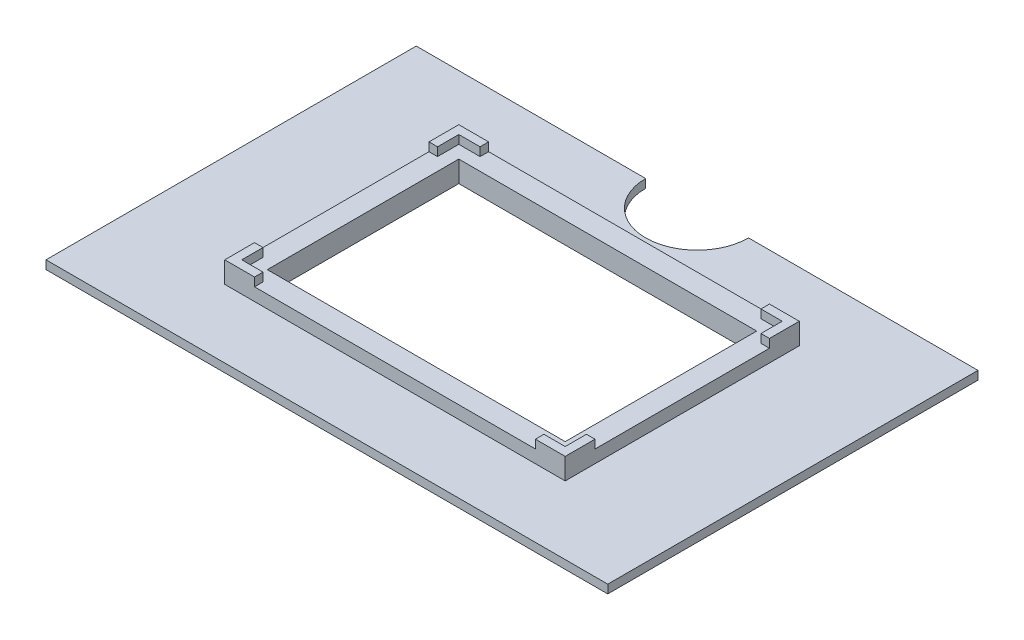
ISO-10303-21;
HEADER;
FILE_DESCRIPTION(('STEP AP214'),'2;1');
FILE_NAME('part.step','',(''),(''),'','','');
FILE_SCHEMA(('AUTOMOTIVE_DESIGN { 1 0 10303 214 1 1 1 1 }'));
ENDSEC;
DATA;
#1=APPLICATION_CONTEXT('core data for automotive mechanical design processes');
#2=APPLICATION_PROTOCOL_DEFINITION('international standard','automotive_design',2000,#1);
#3=PRODUCT_CONTEXT('',#1,'mechanical');
#4=PRODUCT('Part','Part','',(#3));
#5=PRODUCT_RELATED_PRODUCT_CATEGORY('part','',(#4));
#6=PRODUCT_DEFINITION_FORMATION('','',#4);
#7=PRODUCT_DEFINITION_CONTEXT('part definition',#1,'design');
#8=PRODUCT_DEFINITION('design','',#6,#7);
#9=PRODUCT_DEFINITION_SHAPE('','',#8);
#10=(LENGTH_UNIT() NAMED_UNIT(*) SI_UNIT(.MILLI.,.METRE.));
#11=(NAMED_UNIT(*) PLANE_ANGLE_UNIT() SI_UNIT($,.RADIAN.));
#12=(NAMED_UNIT(*) SI_UNIT($,.STERADIAN.) SOLID_ANGLE_UNIT());
#13=UNCERTAINTY_MEASURE_WITH_UNIT(LENGTH_MEASURE(1.E-05),#10,'distance_accuracy_value','');
#14=(GEOMETRIC_REPRESENTATION_CONTEXT(3) GLOBAL_UNCERTAINTY_ASSIGNED_CONTEXT((#13)) GLOBAL_UNIT_ASSIGNED_CONTEXT((#10,
#11,#12)) REPRESENTATION_CONTEXT('',''));
#15=CARTESIAN_POINT('',(0.,0.,0.));
#16=DIRECTION('',(0.,0.,1.));
#17=DIRECTION('',(1.,0.,0.));
#18=AXIS2_PLACEMENT_3D('',#15,#16,#17);
#19=CARTESIAN_POINT('',(66.,2.,-43.5));
#20=DIRECTION('',(0.,0.,1.));
#21=DIRECTION('',(1.,0.,0.));
#22=AXIS2_PLACEMENT_3D('',#19,#20,#21);
#23=PLANE('',#22);
#24=DIRECTION('',(-1.,0.,0.));
#25=VECTOR('',#24,1.);
#26=CARTESIAN_POINT('',(66.,0.,-43.5));
#27=LINE('',#26,#25);
#28=CARTESIAN_POINT('',(66.,0.,-43.5));
#29=VERTEX_POINT('',#28);
#30=CARTESIAN_POINT('',(12.0856084453727,0.,-43.5));
#31=VERTEX_POINT('',#30);
#32=EDGE_CURVE('E266',#29,#31,#27,.T.);
#33=ORIENTED_EDGE('',*,*,#32,.T.);
#34=DIRECTION('',(0.,1.,0.));
#35=VECTOR('',#34,1.);
#36=CARTESIAN_POINT('',(12.0856084453727,-27.0242420332989,-43.5));
#37=LINE('',#36,#35);
#38=CARTESIAN_POINT('',(12.0856084453727,2.,-43.5));
#39=VERTEX_POINT('',#38);
#40=EDGE_CURVE('E48',#31,#39,#37,.T.);
#41=ORIENTED_EDGE('',*,*,#40,.T.);
#42=DIRECTION('',(-1.,0.,0.));
#43=VECTOR('',#42,1.);
#44=CARTESIAN_POINT('',(66.,2.,-43.5));
#45=LINE('',#44,#43);
#46=CARTESIAN_POINT('',(66.,2.,-43.5));
#47=VERTEX_POINT('',#46);
#48=EDGE_CURVE('E264',#47,#39,#45,.T.);
#49=ORIENTED_EDGE('',*,*,#48,.F.);
#50=DIRECTION('',(0.,-1.,0.));
#51=VECTOR('',#50,1.);
#52=CARTESIAN_POINT('',(66.,2.,-43.5));
#53=LINE('',#52,#51);
#54=EDGE_CURVE('E277',#47,#29,#53,.T.);
#55=ORIENTED_EDGE('',*,*,#54,.T.);
#56=EDGE_LOOP('',(#33,#41,#49,#55));
#57=FACE_BOUND('',#56,.T.);
#58=ADVANCED_FACE('F33',(#57),#23,.F.);
#59=CARTESIAN_POINT('',(0.,7.,0.));
#60=DIRECTION('',(0.,1.,0.));
#61=DIRECTION('',(0.,0.,1.));
#62=AXIS2_PLACEMENT_3D('',#59,#60,#61);
#63=PLANE('',#62);
#64=DIRECTION('',(0.,0.,1.));
#65=VECTOR('',#64,1.);
#66=CARTESIAN_POINT('',(-33.,7.,27.5));
#67=LINE('',#66,#65);
#68=CARTESIAN_POINT('',(-33.,7.,25.5));
#69=VERTEX_POINT('',#68);
#70=CARTESIAN_POINT('',(-33.,7.,27.5));
#71=VERTEX_POINT('',#70);
#72=EDGE_CURVE('E306',#69,#71,#67,.T.);
#73=ORIENTED_EDGE('',*,*,#72,.F.);
#74=DIRECTION('',(1.,0.,0.));
#75=VECTOR('',#74,1.);
#76=CARTESIAN_POINT('',(38.,7.,25.5));
#77=LINE('',#76,#75);
#78=CARTESIAN_POINT('',(-38.,7.,25.5));
#79=VERTEX_POINT('',#78);
#80=EDGE_CURVE('E443',#79,#69,#77,.T.);
#81=ORIENTED_EDGE('',*,*,#80,.F.);
#82=DIRECTION('',(0.,0.,1.));
#83=VECTOR('',#82,1.);
#84=CARTESIAN_POINT('',(-38.,7.,25.5));
#85=LINE('',#84,#83);
#86=CARTESIAN_POINT('',(-38.,7.,20.5));
#87=VERTEX_POINT('',#86);
#88=EDGE_CURVE('E421',#87,#79,#85,.T.);
#89=ORIENTED_EDGE('',*,*,#88,.F.);
#90=DIRECTION('',(1.,0.,0.));
#91=VECTOR('',#90,1.);
#92=CARTESIAN_POINT('',(-38.,7.,20.5));
#93=LINE('',#92,#91);
#94=CARTESIAN_POINT('',(-40.,7.,20.5));
#95=VERTEX_POINT('',#94);
#96=EDGE_CURVE('E378',#95,#87,#93,.T.);
#97=ORIENTED_EDGE('',*,*,#96,.F.);
#98=DIRECTION('',(0.,0.,1.));
#99=VECTOR('',#98,1.);
#100=CARTESIAN_POINT('',(-40.,7.,27.5));
#101=LINE('',#100,#99);
#102=CARTESIAN_POINT('',(-40.,7.,27.5));
#103=VERTEX_POINT('',#102);
#104=EDGE_CURVE('E470',#95,#103,#101,.T.);
#105=ORIENTED_EDGE('',*,*,#104,.T.);
#106=DIRECTION('',(1.,0.,0.));
#107=VECTOR('',#106,1.);
#108=CARTESIAN_POINT('',(40.,7.,27.5));
#109=LINE('',#108,#107);
#110=EDGE_CURVE('E471',#103,#71,#109,.T.);
#111=ORIENTED_EDGE('',*,*,#110,.T.);
#112=EDGE_LOOP('',(#73,#81,#89,#97,#105,#111));
#113=FACE_BOUND('',#112,.T.);
#114=ADVANCED_FACE('F521',(#113),#63,.T.);
#115=CARTESIAN_POINT('',(38.,5.,25.5));
#116=DIRECTION('',(0.,0.,1.));
#117=DIRECTION('',(1.,0.,0.));
#118=AXIS2_PLACEMENT_3D('',#115,#116,#117);
#119=PLANE('',#118);
#120=ORIENTED_EDGE('',*,*,#80,.T.);
#121=DIRECTION('',(0.,1.,0.));
#122=VECTOR('',#121,1.);
#123=CARTESIAN_POINT('',(-33.,-61.0302960768767,25.5));
#124=LINE('',#123,#122);
#125=CARTESIAN_POINT('',(-33.,5.,25.5));
#126=VERTEX_POINT('',#125);
#127=EDGE_CURVE('E320',#126,#69,#124,.T.);
#128=ORIENTED_EDGE('',*,*,#127,.F.);
#129=DIRECTION('',(1.,0.,0.));
#130=VECTOR('',#129,1.);
#131=CARTESIAN_POINT('',(38.,5.,25.5));
#132=LINE('',#131,#130);
#133=CARTESIAN_POINT('',(-38.,5.,25.5));
#134=VERTEX_POINT('',#133);
#135=EDGE_CURVE('E427',#134,#126,#132,.T.);
#136=ORIENTED_EDGE('',*,*,#135,.F.);
#137=DIRECTION('',(0.,1.,0.));
#138=VECTOR('',#137,1.);
#139=CARTESIAN_POINT('',(-38.,5.,25.5));
#140=LINE('',#139,#138);
#141=EDGE_CURVE('E438',#134,#79,#140,.T.);
#142=ORIENTED_EDGE('',*,*,#141,.T.);
#143=EDGE_LOOP('',(#120,#128,#136,#142));
#144=FACE_BOUND('',#143,.T.);
#145=ADVANCED_FACE('F526',(#144),#119,.F.);
#146=DIRECTION('',(0.,0.,1.));
#147=VECTOR('',#146,1.);
#148=CARTESIAN_POINT('',(-33.,7.,-27.5));
#149=LINE('',#148,#147);
#150=CARTESIAN_POINT('',(-33.,7.,-27.5));
#151=VERTEX_POINT('',#150);
#152=CARTESIAN_POINT('',(-33.,7.,-25.5));
#153=VERTEX_POINT('',#152);
#154=EDGE_CURVE('E327',#151,#153,#149,.T.);
#155=ORIENTED_EDGE('',*,*,#154,.F.);
#156=DIRECTION('',(-1.,0.,0.));
#157=VECTOR('',#156,1.);
#158=CARTESIAN_POINT('',(40.,7.,-27.5));
#159=LINE('',#158,#157);
#160=CARTESIAN_POINT('',(-40.,7.,-27.5));
#161=VERTEX_POINT('',#160);
#162=EDGE_CURVE('E478',#151,#161,#159,.T.);
#163=ORIENTED_EDGE('',*,*,#162,.T.);
#164=CARTESIAN_POINT('',(-40.,7.,-20.5));
#165=VERTEX_POINT('',#164);
#166=EDGE_CURVE('E466',#161,#165,#101,.T.);
#167=ORIENTED_EDGE('',*,*,#166,.T.);
#168=DIRECTION('',(-1.,0.,0.));
#169=VECTOR('',#168,1.);
#170=CARTESIAN_POINT('',(-38.,7.,-20.5));
#171=LINE('',#170,#169);
#172=CARTESIAN_POINT('',(-38.,7.,-20.5));
#173=VERTEX_POINT('',#172);
#174=EDGE_CURVE('E369',#173,#165,#171,.T.);
#175=ORIENTED_EDGE('',*,*,#174,.F.);
#176=CARTESIAN_POINT('',(-38.,7.,-25.5));
#177=VERTEX_POINT('',#176);
#178=EDGE_CURVE('E439',#177,#173,#85,.T.);
#179=ORIENTED_EDGE('',*,*,#178,.F.);
#180=DIRECTION('',(-1.,0.,0.));
#181=VECTOR('',#180,1.);
#182=CARTESIAN_POINT('',(38.,7.,-25.5));
#183=LINE('',#182,#181);
#184=EDGE_CURVE('E450',#153,#177,#183,.T.);
#185=ORIENTED_EDGE('',*,*,#184,.F.);
#186=EDGE_LOOP('',(#155,#163,#167,#175,#179,#185));
#187=FACE_BOUND('',#186,.T.);
#188=ADVANCED_FACE('F529',(#187),#63,.T.);
#189=CARTESIAN_POINT('',(38.,5.,-25.5));
#190=DIRECTION('',(0.,0.,-1.));
#191=DIRECTION('',(-1.,0.,0.));
#192=AXIS2_PLACEMENT_3D('',#189,#190,#191);
#193=PLANE('',#192);
#194=DIRECTION('',(-1.,0.,0.));
#195=VECTOR('',#194,1.);
#196=CARTESIAN_POINT('',(38.,5.,-25.5));
#197=LINE('',#196,#195);
#198=CARTESIAN_POINT('',(-33.,5.,-25.5));
#199=VERTEX_POINT('',#198);
#200=CARTESIAN_POINT('',(-38.,5.,-25.5));
#201=VERTEX_POINT('',#200);
#202=EDGE_CURVE('E434',#199,#201,#197,.T.);
#203=ORIENTED_EDGE('',*,*,#202,.F.);
#204=DIRECTION('',(0.,1.,0.));
#205=VECTOR('',#204,1.);
#206=CARTESIAN_POINT('',(-33.,-61.0302960768767,-25.5));
#207=LINE('',#206,#205);
#208=EDGE_CURVE('E340',#199,#153,#207,.T.);
#209=ORIENTED_EDGE('',*,*,#208,.T.);
#210=ORIENTED_EDGE('',*,*,#184,.T.);
#211=DIRECTION('',(0.,1.,0.));
#212=VECTOR('',#211,1.);
#213=CARTESIAN_POINT('',(-38.,5.,-25.5));
#214=LINE('',#213,#212);
#215=EDGE_CURVE('E454',#201,#177,#214,.T.);
#216=ORIENTED_EDGE('',*,*,#215,.F.);
#217=EDGE_LOOP('',(#203,#209,#210,#216));
#218=FACE_BOUND('',#217,.T.);
#219=ADVANCED_FACE('F541',(#218),#193,.F.);
#220=DIRECTION('',(0.,0.,-1.));
#221=VECTOR('',#220,1.);
#222=CARTESIAN_POINT('',(33.,7.,-27.5));
#223=LINE('',#222,#221);
#224=CARTESIAN_POINT('',(33.,7.,-25.5));
#225=VERTEX_POINT('',#224);
#226=CARTESIAN_POINT('',(33.,7.,-27.5));
#227=VERTEX_POINT('',#226);
#228=EDGE_CURVE('E338',#225,#227,#223,.T.);
#229=ORIENTED_EDGE('',*,*,#228,.F.);
#230=CARTESIAN_POINT('',(38.,7.,-25.5));
#231=VERTEX_POINT('',#230);
#232=EDGE_CURVE('E451',#231,#225,#183,.T.);
#233=ORIENTED_EDGE('',*,*,#232,.F.);
#234=DIRECTION('',(0.,0.,-1.));
#235=VECTOR('',#234,1.);
#236=CARTESIAN_POINT('',(38.,7.,25.5));
#237=LINE('',#236,#235);
#238=CARTESIAN_POINT('',(38.,7.,-20.5));
#239=VERTEX_POINT('',#238);
#240=EDGE_CURVE('E446',#239,#231,#237,.T.);
#241=ORIENTED_EDGE('',*,*,#240,.F.);
#242=DIRECTION('',(-1.,0.,0.));
#243=VECTOR('',#242,1.);
#244=CARTESIAN_POINT('',(38.,7.,-20.5));
#245=LINE('',#244,#243);
#246=CARTESIAN_POINT('',(40.,7.,-20.5));
#247=VERTEX_POINT('',#246);
#248=EDGE_CURVE('E357',#247,#239,#245,.T.);
#249=ORIENTED_EDGE('',*,*,#248,.F.);
#250=DIRECTION('',(0.,0.,-1.));
#251=VECTOR('',#250,1.);
#252=CARTESIAN_POINT('',(40.,7.,27.5));
#253=LINE('',#252,#251);
#254=CARTESIAN_POINT('',(40.,7.,-27.5));
#255=VERTEX_POINT('',#254);
#256=EDGE_CURVE('E474',#247,#255,#253,.T.);
#257=ORIENTED_EDGE('',*,*,#256,.T.);
#258=EDGE_CURVE('E479',#255,#227,#159,.T.);
#259=ORIENTED_EDGE('',*,*,#258,.T.);
#260=EDGE_LOOP('',(#229,#233,#241,#249,#257,#259));
#261=FACE_BOUND('',#260,.T.);
#262=ADVANCED_FACE('F543',(#261),#63,.T.);
#263=CARTESIAN_POINT('',(38.,5.,25.5));
#264=DIRECTION('',(1.,0.,0.));
#265=DIRECTION('',(0.,0.,-1.));
#266=AXIS2_PLACEMENT_3D('',#263,#264,#265);
#267=PLANE('',#266);
#268=DIRECTION('',(0.,0.,-1.));
#269=VECTOR('',#268,1.);
#270=CARTESIAN_POINT('',(38.,5.,25.5));
#271=LINE('',#270,#269);
#272=CARTESIAN_POINT('',(38.,5.,-20.5));
#273=VERTEX_POINT('',#272);
#274=CARTESIAN_POINT('',(38.,5.,-25.5));
#275=VERTEX_POINT('',#274);
#276=EDGE_CURVE('E430',#273,#275,#271,.T.);
#277=ORIENTED_EDGE('',*,*,#276,.F.);
#278=DIRECTION('',(0.,1.,0.));
#279=VECTOR('',#278,1.);
#280=CARTESIAN_POINT('',(38.,-61.0302960768767,-20.5));
#281=LINE('',#280,#279);
#282=EDGE_CURVE('E353',#273,#239,#281,.T.);
#283=ORIENTED_EDGE('',*,*,#282,.T.);
#284=ORIENTED_EDGE('',*,*,#240,.T.);
#285=DIRECTION('',(0.,1.,0.));
#286=VECTOR('',#285,1.);
#287=CARTESIAN_POINT('',(38.,5.,-25.5));
#288=LINE('',#287,#286);
#289=EDGE_CURVE('E458',#275,#231,#288,.T.);
#290=ORIENTED_EDGE('',*,*,#289,.F.);
#291=EDGE_LOOP('',(#277,#283,#284,#290));
#292=FACE_BOUND('',#291,.T.);
#293=ADVANCED_FACE('F559',(#292),#267,.F.);
#294=CARTESIAN_POINT('',(-38.,5.,25.5));
#295=DIRECTION('',(-1.,0.,0.));
#296=DIRECTION('',(0.,0.,1.));
#297=AXIS2_PLACEMENT_3D('',#294,#295,#296);
#298=PLANE('',#297);
#299=DIRECTION('',(0.,0.,1.));
#300=VECTOR('',#299,1.);
#301=CARTESIAN_POINT('',(-38.,5.,25.5));
#302=LINE('',#301,#300);
#303=CARTESIAN_POINT('',(-38.,5.,20.5));
#304=VERTEX_POINT('',#303);
#305=EDGE_CURVE('E426',#304,#134,#302,.T.);
#306=ORIENTED_EDGE('',*,*,#305,.F.);
#307=DIRECTION('',(0.,1.,0.));
#308=VECTOR('',#307,1.);
#309=CARTESIAN_POINT('',(-38.,-61.0302960768767,20.5));
#310=LINE('',#309,#308);
#311=EDGE_CURVE('E374',#304,#87,#310,.T.);
#312=ORIENTED_EDGE('',*,*,#311,.T.);
#313=ORIENTED_EDGE('',*,*,#88,.T.);
#314=ORIENTED_EDGE('',*,*,#141,.F.);
#315=EDGE_LOOP('',(#306,#312,#313,#314));
#316=FACE_BOUND('',#315,.T.);
#317=ADVANCED_FACE('F554',(#316),#298,.F.);
#318=CARTESIAN_POINT('',(0.,2.,0.));
#319=DIRECTION('',(0.,1.,0.));
#320=DIRECTION('',(0.,0.,1.));
#321=AXIS2_PLACEMENT_3D('',#318,#319,#320);
#322=PLANE('',#321);
#323=CARTESIAN_POINT('',(0.,2.,-43.5));
#324=DIRECTION('',(0.,1.,0.));
#325=DIRECTION('',(0.,0.,1.));
#326=AXIS2_PLACEMENT_3D('',#323,#324,#325);
#327=CIRCLE('',#326,12.0856084453727);
#328=CARTESIAN_POINT('',(-12.0856084453727,2.,-43.5));
#329=VERTEX_POINT('',#328);
#330=EDGE_CURVE('E252',#329,#39,#327,.T.);
#331=ORIENTED_EDGE('',*,*,#330,.F.);
#332=CARTESIAN_POINT('',(-66.,2.,-43.5));
#333=VERTEX_POINT('',#332);
#334=EDGE_CURVE('E274',#329,#333,#45,.T.);
#335=ORIENTED_EDGE('',*,*,#334,.T.);
#336=DIRECTION('',(0.,0.,1.));
#337=VECTOR('',#336,1.);
#338=CARTESIAN_POINT('',(-66.,2.,43.5));
#339=LINE('',#338,#337);
#340=CARTESIAN_POINT('',(-66.,2.,43.5));
#341=VERTEX_POINT('',#340);
#342=EDGE_CURVE('E291',#333,#341,#339,.T.);
#343=ORIENTED_EDGE('',*,*,#342,.T.);
#344=DIRECTION('',(1.,0.,0.));
#345=VECTOR('',#344,1.);
#346=CARTESIAN_POINT('',(66.,2.,43.5));
#347=LINE('',#346,#345);
#348=CARTESIAN_POINT('',(66.,2.,43.5));
#349=VERTEX_POINT('',#348);
#350=EDGE_CURVE('E501',#341,#349,#347,.T.);
#351=ORIENTED_EDGE('',*,*,#350,.T.);
#352=DIRECTION('',(0.,0.,-1.));
#353=VECTOR('',#352,1.);
#354=CARTESIAN_POINT('',(66.,2.,43.5));
#355=LINE('',#354,#353);
#356=EDGE_CURVE('E271',#349,#47,#355,.T.);
#357=ORIENTED_EDGE('',*,*,#356,.T.);
#358=ORIENTED_EDGE('',*,*,#48,.T.);
#359=EDGE_LOOP('',(#331,#335,#343,#351,#357,#358));
#360=FACE_BOUND('',#359,.T.);
#361=DIRECTION('',(1.,0.,0.));
#362=VECTOR('',#361,1.);
#363=CARTESIAN_POINT('',(40.,2.,27.5));
#364=LINE('',#363,#362);
#365=CARTESIAN_POINT('',(-40.,2.,27.5));
#366=VERTEX_POINT('',#365);
#367=CARTESIAN_POINT('',(40.,2.,27.5));
#368=VERTEX_POINT('',#367);
#369=EDGE_CURVE('E485',#366,#368,#364,.T.);
#370=ORIENTED_EDGE('',*,*,#369,.F.);
#371=DIRECTION('',(0.,0.,1.));
#372=VECTOR('',#371,1.);
#373=CARTESIAN_POINT('',(-40.,2.,27.5));
#374=LINE('',#373,#372);
#375=CARTESIAN_POINT('',(-40.,2.,-27.5));
#376=VERTEX_POINT('',#375);
#377=EDGE_CURVE('E457',#376,#366,#374,.T.);
#378=ORIENTED_EDGE('',*,*,#377,.F.);
#379=DIRECTION('',(-1.,0.,0.));
#380=VECTOR('',#379,1.);
#381=CARTESIAN_POINT('',(40.,2.,-27.5));
#382=LINE('',#381,#380);
#383=CARTESIAN_POINT('',(40.,2.,-27.5));
#384=VERTEX_POINT('',#383);
#385=EDGE_CURVE('E490',#384,#376,#382,.T.);
#386=ORIENTED_EDGE('',*,*,#385,.F.);
#387=DIRECTION('',(0.,0.,-1.));
#388=VECTOR('',#387,1.);
#389=CARTESIAN_POINT('',(40.,2.,27.5));
#390=LINE('',#389,#388);
#391=EDGE_CURVE('E487',#368,#384,#390,.T.);
#392=ORIENTED_EDGE('',*,*,#391,.F.);
#393=EDGE_LOOP('',(#370,#378,#386,#392));
#394=FACE_BOUND('',#393,.T.);
#395=ADVANCED_FACE('F268',(#360,#394),#322,.T.);
#396=CARTESIAN_POINT('',(-66.,2.,43.5));
#397=DIRECTION('',(1.,0.,0.));
#398=DIRECTION('',(0.,0.,-1.));
#399=AXIS2_PLACEMENT_3D('',#396,#397,#398);
#400=PLANE('',#399);
#401=DIRECTION('',(0.,0.,1.));
#402=VECTOR('',#401,1.);
#403=CARTESIAN_POINT('',(-66.,0.,43.5));
#404=LINE('',#403,#402);
#405=CARTESIAN_POINT('',(-66.,0.,-43.5));
#406=VERTEX_POINT('',#405);
#407=CARTESIAN_POINT('',(-66.,0.,43.5));
#408=VERTEX_POINT('',#407);
#409=EDGE_CURVE('E282',#406,#408,#404,.T.);
#410=ORIENTED_EDGE('',*,*,#409,.T.);
#411=DIRECTION('',(0.,-1.,0.));
#412=VECTOR('',#411,1.);
#413=CARTESIAN_POINT('',(-66.,2.,43.5));
#414=LINE('',#413,#412);
#415=EDGE_CURVE('E11',#341,#408,#414,.T.);
#416=ORIENTED_EDGE('',*,*,#415,.F.);
#417=ORIENTED_EDGE('',*,*,#342,.F.);
#418=DIRECTION('',(0.,-1.,0.));
#419=VECTOR('',#418,1.);
#420=CARTESIAN_POINT('',(-66.,2.,-43.5));
#421=LINE('',#420,#419);
#422=EDGE_CURVE('E273',#333,#406,#421,.T.);
#423=ORIENTED_EDGE('',*,*,#422,.T.);
#424=EDGE_LOOP('',(#410,#416,#417,#423));
#425=FACE_BOUND('',#424,.T.);
#426=ADVANCED_FACE('F35',(#425),#400,.F.);
#427=CARTESIAN_POINT('',(66.,2.,43.5));
#428=DIRECTION('',(0.,0.,-1.));
#429=DIRECTION('',(-1.,0.,0.));
#430=AXIS2_PLACEMENT_3D('',#427,#428,#429);
#431=PLANE('',#430);
#432=DIRECTION('',(1.,0.,0.));
#433=VECTOR('',#432,1.);
#434=CARTESIAN_POINT('',(66.,0.,43.5));
#435=LINE('',#434,#433);
#436=CARTESIAN_POINT('',(66.,0.,43.5));
#437=VERTEX_POINT('',#436);
#438=EDGE_CURVE('E285',#408,#437,#435,.T.);
#439=ORIENTED_EDGE('',*,*,#438,.T.);
#440=DIRECTION('',(0.,-1.,0.));
#441=VECTOR('',#440,1.);
#442=CARTESIAN_POINT('',(66.,2.,43.5));
#443=LINE('',#442,#441);
#444=EDGE_CURVE('E41',#349,#437,#443,.T.);
#445=ORIENTED_EDGE('',*,*,#444,.F.);
#446=ORIENTED_EDGE('',*,*,#350,.F.);
#447=ORIENTED_EDGE('',*,*,#415,.T.);
#448=EDGE_LOOP('',(#439,#445,#446,#447));
#449=FACE_BOUND('',#448,.T.);
#450=ADVANCED_FACE('F504',(#449),#431,.F.);
#451=CARTESIAN_POINT('',(66.,2.,43.5));
#452=DIRECTION('',(-1.,0.,0.));
#453=DIRECTION('',(0.,0.,1.));
#454=AXIS2_PLACEMENT_3D('',#451,#452,#453);
#455=PLANE('',#454);
#456=DIRECTION('',(0.,0.,-1.));
#457=VECTOR('',#456,1.);
#458=CARTESIAN_POINT('',(66.,0.,43.5));
#459=LINE('',#458,#457);
#460=EDGE_CURVE('E288',#437,#29,#459,.T.);
#461=ORIENTED_EDGE('',*,*,#460,.T.);
#462=ORIENTED_EDGE('',*,*,#54,.F.);
#463=ORIENTED_EDGE('',*,*,#356,.F.);
#464=ORIENTED_EDGE('',*,*,#444,.T.);
#465=EDGE_LOOP('',(#461,#462,#463,#464));
#466=FACE_BOUND('',#465,.T.);
#467=ADVANCED_FACE('F297',(#466),#455,.F.);
#468=ORIENTED_EDGE('',*,*,#334,.F.);
#469=DIRECTION('',(0.,1.,0.));
#470=VECTOR('',#469,1.);
#471=CARTESIAN_POINT('',(-12.0856084453727,-27.0242420332989,-43.5));
#472=LINE('',#471,#470);
#473=CARTESIAN_POINT('',(-12.0856084453727,0.,-43.5));
#474=VERTEX_POINT('',#473);
#475=EDGE_CURVE('E255',#474,#329,#472,.T.);
#476=ORIENTED_EDGE('',*,*,#475,.F.);
#477=EDGE_CURVE('E290',#474,#406,#27,.T.);
#478=ORIENTED_EDGE('',*,*,#477,.T.);
#479=ORIENTED_EDGE('',*,*,#422,.F.);
#480=EDGE_LOOP('',(#468,#476,#478,#479));
#481=FACE_BOUND('',#480,.T.);
#482=ADVANCED_FACE('F508',(#481),#23,.F.);
#483=CARTESIAN_POINT('',(0.,0.,0.));
#484=DIRECTION('',(0.,1.,0.));
#485=DIRECTION('',(0.,0.,1.));
#486=AXIS2_PLACEMENT_3D('',#483,#484,#485);
#487=PLANE('',#486);
#488=DIRECTION('',(-1.,0.,0.));
#489=VECTOR('',#488,1.);
#490=CARTESIAN_POINT('',(-35.,0.,22.5));
#491=LINE('',#490,#489);
#492=CARTESIAN_POINT('',(35.,0.,22.5));
#493=VERTEX_POINT('',#492);
#494=CARTESIAN_POINT('',(-35.,0.,22.5));
#495=VERTEX_POINT('',#494);
#496=EDGE_CURVE('E392',#493,#495,#491,.T.);
#497=ORIENTED_EDGE('',*,*,#496,.F.);
#498=DIRECTION('',(0.,0.,1.));
#499=VECTOR('',#498,1.);
#500=CARTESIAN_POINT('',(35.,0.,-22.5));
#501=LINE('',#500,#499);
#502=CARTESIAN_POINT('',(35.,0.,-22.5));
#503=VERTEX_POINT('',#502);
#504=EDGE_CURVE('E395',#503,#493,#501,.T.);
#505=ORIENTED_EDGE('',*,*,#504,.F.);
#506=DIRECTION('',(1.,0.,0.));
#507=VECTOR('',#506,1.);
#508=CARTESIAN_POINT('',(-35.,0.,-22.5));
#509=LINE('',#508,#507);
#510=CARTESIAN_POINT('',(-35.,0.,-22.5));
#511=VERTEX_POINT('',#510);
#512=EDGE_CURVE('E412',#511,#503,#509,.T.);
#513=ORIENTED_EDGE('',*,*,#512,.F.);
#514=DIRECTION('',(0.,0.,-1.));
#515=VECTOR('',#514,1.);
#516=CARTESIAN_POINT('',(-35.,0.,-22.5));
#517=LINE('',#516,#515);
#518=EDGE_CURVE('E390',#495,#511,#517,.T.);
#519=ORIENTED_EDGE('',*,*,#518,.F.);
#520=EDGE_LOOP('',(#497,#505,#513,#519));
#521=FACE_BOUND('',#520,.T.);
#522=ORIENTED_EDGE('',*,*,#477,.F.);
#523=CARTESIAN_POINT('',(0.,0.,-43.5));
#524=DIRECTION('',(0.,1.,0.));
#525=DIRECTION('',(0.,0.,1.));
#526=AXIS2_PLACEMENT_3D('',#523,#524,#525);
#527=CIRCLE('',#526,12.0856084453727);
#528=EDGE_CURVE('E303',#31,#474,#527,.F.);
#529=ORIENTED_EDGE('',*,*,#528,.F.);
#530=ORIENTED_EDGE('',*,*,#32,.F.);
#531=ORIENTED_EDGE('',*,*,#460,.F.);
#532=ORIENTED_EDGE('',*,*,#438,.F.);
#533=ORIENTED_EDGE('',*,*,#409,.F.);
#534=EDGE_LOOP('',(#522,#529,#530,#531,#532,#533));
#535=FACE_BOUND('',#534,.T.);
#536=ADVANCED_FACE('F301',(#521,#535),#487,.F.);
#537=CARTESIAN_POINT('',(-40.,7.,27.5));
#538=DIRECTION('',(1.,0.,0.));
#539=DIRECTION('',(0.,0.,-1.));
#540=AXIS2_PLACEMENT_3D('',#537,#538,#539);
#541=PLANE('',#540);
#542=ORIENTED_EDGE('',*,*,#104,.F.);
#543=DIRECTION('',(0.,1.,0.));
#544=VECTOR('',#543,1.);
#545=CARTESIAN_POINT('',(-40.,-61.0302960768767,20.5));
#546=LINE('',#545,#544);
#547=CARTESIAN_POINT('',(-40.,5.,20.5));
#548=VERTEX_POINT('',#547);
#549=EDGE_CURVE('E383',#548,#95,#546,.T.);
#550=ORIENTED_EDGE('',*,*,#549,.F.);
#551=DIRECTION('',(0.,0.,-1.));
#552=VECTOR('',#551,1.);
#553=CARTESIAN_POINT('',(-40.,5.,-20.5));
#554=LINE('',#553,#552);
#555=CARTESIAN_POINT('',(-40.,5.,-20.5));
#556=VERTEX_POINT('',#555);
#557=EDGE_CURVE('E370',#548,#556,#554,.T.);
#558=ORIENTED_EDGE('',*,*,#557,.T.);
#559=DIRECTION('',(0.,1.,0.));
#560=VECTOR('',#559,1.);
#561=CARTESIAN_POINT('',(-40.,-61.0302960768767,-20.5));
#562=LINE('',#561,#560);
#563=EDGE_CURVE('E385',#556,#165,#562,.T.);
#564=ORIENTED_EDGE('',*,*,#563,.T.);
#565=ORIENTED_EDGE('',*,*,#166,.F.);
#566=DIRECTION('',(0.,-1.,0.));
#567=VECTOR('',#566,1.);
#568=CARTESIAN_POINT('',(-40.,7.,-27.5));
#569=LINE('',#568,#567);
#570=EDGE_CURVE('E482',#161,#376,#569,.T.);
#571=ORIENTED_EDGE('',*,*,#570,.T.);
#572=ORIENTED_EDGE('',*,*,#377,.T.);
#573=DIRECTION('',(0.,-1.,0.));
#574=VECTOR('',#573,1.);
#575=CARTESIAN_POINT('',(-40.,7.,27.5));
#576=LINE('',#575,#574);
#577=EDGE_CURVE('E286',#103,#366,#576,.T.);
#578=ORIENTED_EDGE('',*,*,#577,.F.);
#579=EDGE_LOOP('',(#542,#550,#558,#564,#565,#571,#572,#578));
#580=FACE_BOUND('',#579,.T.);
#581=ADVANCED_FACE('F515',(#580),#541,.F.);
#582=CARTESIAN_POINT('',(40.,7.,27.5));
#583=DIRECTION('',(0.,0.,-1.));
#584=DIRECTION('',(-1.,0.,0.));
#585=AXIS2_PLACEMENT_3D('',#582,#583,#584);
#586=PLANE('',#585);
#587=DIRECTION('',(-1.,0.,0.));
#588=VECTOR('',#587,1.);
#589=CARTESIAN_POINT('',(-33.,5.,27.5));
#590=LINE('',#589,#588);
#591=CARTESIAN_POINT('',(33.,5.,27.5));
#592=VERTEX_POINT('',#591);
#593=CARTESIAN_POINT('',(-33.,5.,27.5));
#594=VERTEX_POINT('',#593);
#595=EDGE_CURVE('E312',#592,#594,#590,.T.);
#596=ORIENTED_EDGE('',*,*,#595,.T.);
#597=DIRECTION('',(0.,1.,0.));
#598=VECTOR('',#597,1.);
#599=CARTESIAN_POINT('',(-33.,-61.0302960768767,27.5));
#600=LINE('',#599,#598);
#601=EDGE_CURVE('E313',#594,#71,#600,.T.);
#602=ORIENTED_EDGE('',*,*,#601,.T.);
#603=ORIENTED_EDGE('',*,*,#110,.F.);
#604=ORIENTED_EDGE('',*,*,#577,.T.);
#605=ORIENTED_EDGE('',*,*,#369,.T.);
#606=DIRECTION('',(0.,-1.,0.));
#607=VECTOR('',#606,1.);
#608=CARTESIAN_POINT('',(40.,7.,27.5));
#609=LINE('',#608,#607);
#610=CARTESIAN_POINT('',(40.,7.,27.5));
#611=VERTEX_POINT('',#610);
#612=EDGE_CURVE('E496',#611,#368,#609,.T.);
#613=ORIENTED_EDGE('',*,*,#612,.F.);
#614=CARTESIAN_POINT('',(33.,7.,27.5));
#615=VERTEX_POINT('',#614);
#616=EDGE_CURVE('E469',#615,#611,#109,.T.);
#617=ORIENTED_EDGE('',*,*,#616,.F.);
#618=DIRECTION('',(0.,1.,0.));
#619=VECTOR('',#618,1.);
#620=CARTESIAN_POINT('',(33.,-61.0302960768767,27.5));
#621=LINE('',#620,#619);
#622=EDGE_CURVE('E317',#592,#615,#621,.T.);
#623=ORIENTED_EDGE('',*,*,#622,.F.);
#624=EDGE_LOOP('',(#596,#602,#603,#604,#605,#613,#617,#623));
#625=FACE_BOUND('',#624,.T.);
#626=ADVANCED_FACE('F688',(#625),#586,.F.);
#627=CARTESIAN_POINT('',(40.,7.,27.5));
#628=DIRECTION('',(-1.,0.,0.));
#629=DIRECTION('',(0.,0.,1.));
#630=AXIS2_PLACEMENT_3D('',#627,#628,#629);
#631=PLANE('',#630);
#632=ORIENTED_EDGE('',*,*,#256,.F.);
#633=DIRECTION('',(0.,1.,0.));
#634=VECTOR('',#633,1.);
#635=CARTESIAN_POINT('',(40.,-61.0302960768767,-20.5));
#636=LINE('',#635,#634);
#637=CARTESIAN_POINT('',(40.,5.,-20.5));
#638=VERTEX_POINT('',#637);
#639=EDGE_CURVE('E362',#638,#247,#636,.T.);
#640=ORIENTED_EDGE('',*,*,#639,.F.);
#641=DIRECTION('',(0.,0.,1.));
#642=VECTOR('',#641,1.);
#643=CARTESIAN_POINT('',(40.,5.,-20.5));
#644=LINE('',#643,#642);
#645=CARTESIAN_POINT('',(40.,5.,20.5));
#646=VERTEX_POINT('',#645);
#647=EDGE_CURVE('E349',#638,#646,#644,.T.);
#648=ORIENTED_EDGE('',*,*,#647,.T.);
#649=DIRECTION('',(0.,1.,0.));
#650=VECTOR('',#649,1.);
#651=CARTESIAN_POINT('',(40.,-61.0302960768767,20.5));
#652=LINE('',#651,#650);
#653=CARTESIAN_POINT('',(40.,7.,20.5));
#654=VERTEX_POINT('',#653);
#655=EDGE_CURVE('E364',#646,#654,#652,.T.);
#656=ORIENTED_EDGE('',*,*,#655,.T.);
#657=EDGE_CURVE('E475',#611,#654,#253,.T.);
#658=ORIENTED_EDGE('',*,*,#657,.F.);
#659=ORIENTED_EDGE('',*,*,#612,.T.);
#660=ORIENTED_EDGE('',*,*,#391,.T.);
#661=DIRECTION('',(0.,-1.,0.));
#662=VECTOR('',#661,1.);
#663=CARTESIAN_POINT('',(40.,7.,-27.5));
#664=LINE('',#663,#662);
#665=EDGE_CURVE('E494',#255,#384,#664,.T.);
#666=ORIENTED_EDGE('',*,*,#665,.F.);
#667=EDGE_LOOP('',(#632,#640,#648,#656,#658,#659,#660,#666));
#668=FACE_BOUND('',#667,.T.);
#669=ADVANCED_FACE('F555',(#668),#631,.F.);
#670=CARTESIAN_POINT('',(40.,7.,-27.5));
#671=DIRECTION('',(0.,0.,1.));
#672=DIRECTION('',(1.,0.,0.));
#673=AXIS2_PLACEMENT_3D('',#670,#671,#672);
#674=PLANE('',#673);
#675=ORIENTED_EDGE('',*,*,#162,.F.);
#676=DIRECTION('',(0.,1.,0.));
#677=VECTOR('',#676,1.);
#678=CARTESIAN_POINT('',(-33.,-61.0302960768767,-27.5));
#679=LINE('',#678,#677);
#680=CARTESIAN_POINT('',(-33.,5.,-27.5));
#681=VERTEX_POINT('',#680);
#682=EDGE_CURVE('E331',#681,#151,#679,.T.);
#683=ORIENTED_EDGE('',*,*,#682,.F.);
#684=DIRECTION('',(1.,0.,0.));
#685=VECTOR('',#684,1.);
#686=CARTESIAN_POINT('',(-33.,5.,-27.5));
#687=LINE('',#686,#685);
#688=CARTESIAN_POINT('',(33.,5.,-27.5));
#689=VERTEX_POINT('',#688);
#690=EDGE_CURVE('E330',#681,#689,#687,.T.);
#691=ORIENTED_EDGE('',*,*,#690,.T.);
#692=DIRECTION('',(0.,1.,0.));
#693=VECTOR('',#692,1.);
#694=CARTESIAN_POINT('',(33.,-61.0302960768767,-27.5));
#695=LINE('',#694,#693);
#696=EDGE_CURVE('E342',#689,#227,#695,.T.);
#697=ORIENTED_EDGE('',*,*,#696,.T.);
#698=ORIENTED_EDGE('',*,*,#258,.F.);
#699=ORIENTED_EDGE('',*,*,#665,.T.);
#700=ORIENTED_EDGE('',*,*,#385,.T.);
#701=ORIENTED_EDGE('',*,*,#570,.F.);
#702=EDGE_LOOP('',(#675,#683,#691,#697,#698,#699,#700,#701));
#703=FACE_BOUND('',#702,.T.);
#704=ADVANCED_FACE('F546',(#703),#674,.F.);
#705=DIRECTION('',(0.,0.,-1.));
#706=VECTOR('',#705,1.);
#707=CARTESIAN_POINT('',(33.,7.,27.5));
#708=LINE('',#707,#706);
#709=CARTESIAN_POINT('',(33.,7.,25.5));
#710=VERTEX_POINT('',#709);
#711=EDGE_CURVE('E304',#615,#710,#708,.T.);
#712=ORIENTED_EDGE('',*,*,#711,.F.);
#713=ORIENTED_EDGE('',*,*,#616,.T.);
#714=ORIENTED_EDGE('',*,*,#657,.T.);
#715=DIRECTION('',(1.,0.,0.));
#716=VECTOR('',#715,1.);
#717=CARTESIAN_POINT('',(38.,7.,20.5));
#718=LINE('',#717,#716);
#719=CARTESIAN_POINT('',(38.,7.,20.5));
#720=VERTEX_POINT('',#719);
#721=EDGE_CURVE('E336',#720,#654,#718,.T.);
#722=ORIENTED_EDGE('',*,*,#721,.F.);
#723=CARTESIAN_POINT('',(38.,7.,25.5));
#724=VERTEX_POINT('',#723);
#725=EDGE_CURVE('E447',#724,#720,#237,.T.);
#726=ORIENTED_EDGE('',*,*,#725,.F.);
#727=EDGE_CURVE('E442',#710,#724,#77,.T.);
#728=ORIENTED_EDGE('',*,*,#727,.F.);
#729=EDGE_LOOP('',(#712,#713,#714,#722,#726,#728));
#730=FACE_BOUND('',#729,.T.);
#731=ADVANCED_FACE('F530',(#730),#63,.T.);
#732=ORIENTED_EDGE('',*,*,#178,.T.);
#733=DIRECTION('',(0.,1.,0.));
#734=VECTOR('',#733,1.);
#735=CARTESIAN_POINT('',(-38.,-61.0302960768767,-20.5));
#736=LINE('',#735,#734);
#737=CARTESIAN_POINT('',(-38.,5.,-20.5));
#738=VERTEX_POINT('',#737);
#739=EDGE_CURVE('E380',#738,#173,#736,.T.);
#740=ORIENTED_EDGE('',*,*,#739,.F.);
#741=EDGE_CURVE('E422',#201,#738,#302,.T.);
#742=ORIENTED_EDGE('',*,*,#741,.F.);
#743=ORIENTED_EDGE('',*,*,#215,.T.);
#744=EDGE_LOOP('',(#732,#740,#742,#743));
#745=FACE_BOUND('',#744,.T.);
#746=ADVANCED_FACE('F545',(#745),#298,.F.);
#747=ORIENTED_EDGE('',*,*,#232,.T.);
#748=DIRECTION('',(0.,1.,0.));
#749=VECTOR('',#748,1.);
#750=CARTESIAN_POINT('',(33.,-61.0302960768767,-25.5));
#751=LINE('',#750,#749);
#752=CARTESIAN_POINT('',(33.,5.,-25.5));
#753=VERTEX_POINT('',#752);
#754=EDGE_CURVE('E345',#753,#225,#751,.T.);
#755=ORIENTED_EDGE('',*,*,#754,.F.);
#756=EDGE_CURVE('E435',#275,#753,#197,.T.);
#757=ORIENTED_EDGE('',*,*,#756,.F.);
#758=ORIENTED_EDGE('',*,*,#289,.T.);
#759=EDGE_LOOP('',(#747,#755,#757,#758));
#760=FACE_BOUND('',#759,.T.);
#761=ADVANCED_FACE('F552',(#760),#193,.F.);
#762=ORIENTED_EDGE('',*,*,#725,.T.);
#763=DIRECTION('',(0.,1.,0.));
#764=VECTOR('',#763,1.);
#765=CARTESIAN_POINT('',(38.,-61.0302960768767,20.5));
#766=LINE('',#765,#764);
#767=CARTESIAN_POINT('',(38.,5.,20.5));
#768=VERTEX_POINT('',#767);
#769=EDGE_CURVE('E359',#768,#720,#766,.T.);
#770=ORIENTED_EDGE('',*,*,#769,.F.);
#771=CARTESIAN_POINT('',(38.,5.,25.5));
#772=VERTEX_POINT('',#771);
#773=EDGE_CURVE('E431',#772,#768,#271,.T.);
#774=ORIENTED_EDGE('',*,*,#773,.F.);
#775=DIRECTION('',(0.,1.,0.));
#776=VECTOR('',#775,1.);
#777=CARTESIAN_POINT('',(38.,5.,25.5));
#778=LINE('',#777,#776);
#779=EDGE_CURVE('E461',#772,#724,#778,.T.);
#780=ORIENTED_EDGE('',*,*,#779,.T.);
#781=EDGE_LOOP('',(#762,#770,#774,#780));
#782=FACE_BOUND('',#781,.T.);
#783=ADVANCED_FACE('F567',(#782),#267,.F.);
#784=CARTESIAN_POINT('',(33.,5.,25.5));
#785=VERTEX_POINT('',#784);
#786=EDGE_CURVE('E425',#785,#772,#132,.T.);
#787=ORIENTED_EDGE('',*,*,#786,.F.);
#788=DIRECTION('',(0.,1.,0.));
#789=VECTOR('',#788,1.);
#790=CARTESIAN_POINT('',(33.,-61.0302960768767,25.5));
#791=LINE('',#790,#789);
#792=EDGE_CURVE('E322',#785,#710,#791,.T.);
#793=ORIENTED_EDGE('',*,*,#792,.T.);
#794=ORIENTED_EDGE('',*,*,#727,.T.);
#795=ORIENTED_EDGE('',*,*,#779,.F.);
#796=EDGE_LOOP('',(#787,#793,#794,#795));
#797=FACE_BOUND('',#796,.T.);
#798=ADVANCED_FACE('F536',(#797),#119,.F.);
#799=CARTESIAN_POINT('',(0.,5.,0.));
#800=DIRECTION('',(0.,1.,0.));
#801=DIRECTION('',(0.,0.,1.));
#802=AXIS2_PLACEMENT_3D('',#799,#800,#801);
#803=PLANE('',#802);
#804=DIRECTION('',(0.,0.,-1.));
#805=VECTOR('',#804,1.);
#806=CARTESIAN_POINT('',(35.,5.,-22.5));
#807=LINE('',#806,#805);
#808=CARTESIAN_POINT('',(35.,5.,22.5));
#809=VERTEX_POINT('',#808);
#810=CARTESIAN_POINT('',(35.,5.,-22.5));
#811=VERTEX_POINT('',#810);
#812=EDGE_CURVE('E398',#809,#811,#807,.T.);
#813=ORIENTED_EDGE('',*,*,#812,.F.);
#814=DIRECTION('',(1.,0.,0.));
#815=VECTOR('',#814,1.);
#816=CARTESIAN_POINT('',(-35.,5.,22.5));
#817=LINE('',#816,#815);
#818=CARTESIAN_POINT('',(-35.,5.,22.5));
#819=VERTEX_POINT('',#818);
#820=EDGE_CURVE('E406',#819,#809,#817,.T.);
#821=ORIENTED_EDGE('',*,*,#820,.F.);
#822=DIRECTION('',(0.,0.,1.));
#823=VECTOR('',#822,1.);
#824=CARTESIAN_POINT('',(-35.,5.,-22.5));
#825=LINE('',#824,#823);
#826=CARTESIAN_POINT('',(-35.,5.,-22.5));
#827=VERTEX_POINT('',#826);
#828=EDGE_CURVE('E403',#827,#819,#825,.T.);
#829=ORIENTED_EDGE('',*,*,#828,.F.);
#830=DIRECTION('',(-1.,0.,0.));
#831=VECTOR('',#830,1.);
#832=CARTESIAN_POINT('',(-35.,5.,-22.5));
#833=LINE('',#832,#831);
#834=EDGE_CURVE('E400',#811,#827,#833,.T.);
#835=ORIENTED_EDGE('',*,*,#834,.F.);
#836=EDGE_LOOP('',(#813,#821,#829,#835));
#837=FACE_BOUND('',#836,.T.);
#838=ORIENTED_EDGE('',*,*,#741,.T.);
#839=DIRECTION('',(1.,0.,0.));
#840=VECTOR('',#839,1.);
#841=CARTESIAN_POINT('',(-38.,5.,-20.5));
#842=LINE('',#841,#840);
#843=EDGE_CURVE('E376',#556,#738,#842,.T.);
#844=ORIENTED_EDGE('',*,*,#843,.F.);
#845=ORIENTED_EDGE('',*,*,#557,.F.);
#846=DIRECTION('',(-1.,0.,0.));
#847=VECTOR('',#846,1.);
#848=CARTESIAN_POINT('',(-38.,5.,20.5));
#849=LINE('',#848,#847);
#850=EDGE_CURVE('E373',#304,#548,#849,.T.);
#851=ORIENTED_EDGE('',*,*,#850,.F.);
#852=ORIENTED_EDGE('',*,*,#305,.T.);
#853=ORIENTED_EDGE('',*,*,#135,.T.);
#854=DIRECTION('',(0.,0.,-1.));
#855=VECTOR('',#854,1.);
#856=CARTESIAN_POINT('',(-33.,5.,27.5));
#857=LINE('',#856,#855);
#858=EDGE_CURVE('E310',#594,#126,#857,.T.);
#859=ORIENTED_EDGE('',*,*,#858,.F.);
#860=ORIENTED_EDGE('',*,*,#595,.F.);
#861=DIRECTION('',(0.,0.,1.));
#862=VECTOR('',#861,1.);
#863=CARTESIAN_POINT('',(33.,5.,27.5));
#864=LINE('',#863,#862);
#865=EDGE_CURVE('E56',#785,#592,#864,.T.);
#866=ORIENTED_EDGE('',*,*,#865,.F.);
#867=ORIENTED_EDGE('',*,*,#786,.T.);
#868=ORIENTED_EDGE('',*,*,#773,.T.);
#869=DIRECTION('',(-1.,0.,0.));
#870=VECTOR('',#869,1.);
#871=CARTESIAN_POINT('',(38.,5.,20.5));
#872=LINE('',#871,#870);
#873=EDGE_CURVE('E355',#646,#768,#872,.T.);
#874=ORIENTED_EDGE('',*,*,#873,.F.);
#875=ORIENTED_EDGE('',*,*,#647,.F.);
#876=DIRECTION('',(1.,0.,0.));
#877=VECTOR('',#876,1.);
#878=CARTESIAN_POINT('',(38.,5.,-20.5));
#879=LINE('',#878,#877);
#880=EDGE_CURVE('E352',#273,#638,#879,.T.);
#881=ORIENTED_EDGE('',*,*,#880,.F.);
#882=ORIENTED_EDGE('',*,*,#276,.T.);
#883=ORIENTED_EDGE('',*,*,#756,.T.);
#884=DIRECTION('',(0.,0.,1.));
#885=VECTOR('',#884,1.);
#886=CARTESIAN_POINT('',(33.,5.,-27.5));
#887=LINE('',#886,#885);
#888=EDGE_CURVE('E328',#689,#753,#887,.T.);
#889=ORIENTED_EDGE('',*,*,#888,.F.);
#890=ORIENTED_EDGE('',*,*,#690,.F.);
#891=DIRECTION('',(0.,0.,-1.));
#892=VECTOR('',#891,1.);
#893=CARTESIAN_POINT('',(-33.,5.,-27.5));
#894=LINE('',#893,#892);
#895=EDGE_CURVE('E334',#199,#681,#894,.T.);
#896=ORIENTED_EDGE('',*,*,#895,.F.);
#897=ORIENTED_EDGE('',*,*,#202,.T.);
#898=EDGE_LOOP('',(#838,#844,#845,#851,#852,#853,#859,#860,#866,#867,#868,#874,#875,#881,#882,
#883,#889,#890,#896,#897));
#899=FACE_BOUND('',#898,.T.);
#900=ADVANCED_FACE('F593',(#837,#899),#803,.T.);
#901=CARTESIAN_POINT('',(35.,-0.00100000000000013,-22.5));
#902=DIRECTION('',(1.,0.,0.));
#903=DIRECTION('',(0.,0.,-1.));
#904=AXIS2_PLACEMENT_3D('',#901,#902,#903);
#905=PLANE('',#904);
#906=ORIENTED_EDGE('',*,*,#504,.T.);
#907=DIRECTION('',(0.,1.,0.));
#908=VECTOR('',#907,1.);
#909=CARTESIAN_POINT('',(35.,-0.00100000000000013,22.5));
#910=LINE('',#909,#908);
#911=EDGE_CURVE('E410',#493,#809,#910,.T.);
#912=ORIENTED_EDGE('',*,*,#911,.T.);
#913=ORIENTED_EDGE('',*,*,#812,.T.);
#914=DIRECTION('',(0.,1.,0.));
#915=VECTOR('',#914,1.);
#916=CARTESIAN_POINT('',(35.,-0.00100000000000013,-22.5));
#917=LINE('',#916,#915);
#918=EDGE_CURVE('E409',#503,#811,#917,.T.);
#919=ORIENTED_EDGE('',*,*,#918,.F.);
#920=EDGE_LOOP('',(#906,#912,#913,#919));
#921=FACE_BOUND('',#920,.T.);
#922=ADVANCED_FACE('F624',(#921),#905,.F.);
#923=CARTESIAN_POINT('',(-35.,-0.00100000000000013,22.5));
#924=DIRECTION('',(0.,0.,1.));
#925=DIRECTION('',(1.,0.,0.));
#926=AXIS2_PLACEMENT_3D('',#923,#924,#925);
#927=PLANE('',#926);
#928=ORIENTED_EDGE('',*,*,#496,.T.);
#929=DIRECTION('',(0.,1.,0.));
#930=VECTOR('',#929,1.);
#931=CARTESIAN_POINT('',(-35.,-0.00100000000000013,22.5));
#932=LINE('',#931,#930);
#933=EDGE_CURVE('E413',#495,#819,#932,.T.);
#934=ORIENTED_EDGE('',*,*,#933,.T.);
#935=ORIENTED_EDGE('',*,*,#820,.T.);
#936=ORIENTED_EDGE('',*,*,#911,.F.);
#937=EDGE_LOOP('',(#928,#934,#935,#936));
#938=FACE_BOUND('',#937,.T.);
#939=ADVANCED_FACE('F620',(#938),#927,.F.);
#940=CARTESIAN_POINT('',(-35.,-0.00100000000000013,-22.5));
#941=DIRECTION('',(-1.,0.,0.));
#942=DIRECTION('',(0.,0.,1.));
#943=AXIS2_PLACEMENT_3D('',#940,#941,#942);
#944=PLANE('',#943);
#945=ORIENTED_EDGE('',*,*,#518,.T.);
#946=DIRECTION('',(0.,1.,0.));
#947=VECTOR('',#946,1.);
#948=CARTESIAN_POINT('',(-35.,-0.00100000000000013,-22.5));
#949=LINE('',#948,#947);
#950=EDGE_CURVE('E415',#511,#827,#949,.T.);
#951=ORIENTED_EDGE('',*,*,#950,.T.);
#952=ORIENTED_EDGE('',*,*,#828,.T.);
#953=ORIENTED_EDGE('',*,*,#933,.F.);
#954=EDGE_LOOP('',(#945,#951,#952,#953));
#955=FACE_BOUND('',#954,.T.);
#956=ADVANCED_FACE('F623',(#955),#944,.F.);
#957=CARTESIAN_POINT('',(-35.,-0.00100000000000013,-22.5));
#958=DIRECTION('',(0.,0.,-1.));
#959=DIRECTION('',(-1.,0.,0.));
#960=AXIS2_PLACEMENT_3D('',#957,#958,#959);
#961=PLANE('',#960);
#962=ORIENTED_EDGE('',*,*,#512,.T.);
#963=ORIENTED_EDGE('',*,*,#918,.T.);
#964=ORIENTED_EDGE('',*,*,#834,.T.);
#965=ORIENTED_EDGE('',*,*,#950,.F.);
#966=EDGE_LOOP('',(#962,#963,#964,#965));
#967=FACE_BOUND('',#966,.T.);
#968=ADVANCED_FACE('F617',(#967),#961,.F.);
#969=CARTESIAN_POINT('',(-38.,-61.0302960768767,20.5));
#970=DIRECTION('',(0.,0.,1.));
#971=DIRECTION('',(1.,0.,0.));
#972=AXIS2_PLACEMENT_3D('',#969,#970,#971);
#973=PLANE('',#972);
#974=ORIENTED_EDGE('',*,*,#850,.T.);
#975=ORIENTED_EDGE('',*,*,#549,.T.);
#976=ORIENTED_EDGE('',*,*,#96,.T.);
#977=ORIENTED_EDGE('',*,*,#311,.F.);
#978=EDGE_LOOP('',(#974,#975,#976,#977));
#979=FACE_BOUND('',#978,.T.);
#980=ADVANCED_FACE('F610',(#979),#973,.F.);
#981=CARTESIAN_POINT('',(-38.,-61.0302960768767,-20.5));
#982=DIRECTION('',(0.,0.,-1.));
#983=DIRECTION('',(-1.,0.,0.));
#984=AXIS2_PLACEMENT_3D('',#981,#982,#983);
#985=PLANE('',#984);
#986=ORIENTED_EDGE('',*,*,#843,.T.);
#987=ORIENTED_EDGE('',*,*,#739,.T.);
#988=ORIENTED_EDGE('',*,*,#174,.T.);
#989=ORIENTED_EDGE('',*,*,#563,.F.);
#990=EDGE_LOOP('',(#986,#987,#988,#989));
#991=FACE_BOUND('',#990,.T.);
#992=ADVANCED_FACE('F601',(#991),#985,.F.);
#993=CARTESIAN_POINT('',(38.,-61.0302960768767,-20.5));
#994=DIRECTION('',(0.,0.,-1.));
#995=DIRECTION('',(-1.,0.,0.));
#996=AXIS2_PLACEMENT_3D('',#993,#994,#995);
#997=PLANE('',#996);
#998=ORIENTED_EDGE('',*,*,#880,.T.);
#999=ORIENTED_EDGE('',*,*,#639,.T.);
#1000=ORIENTED_EDGE('',*,*,#248,.T.);
#1001=ORIENTED_EDGE('',*,*,#282,.F.);
#1002=EDGE_LOOP('',(#998,#999,#1000,#1001));
#1003=FACE_BOUND('',#1002,.T.);
#1004=ADVANCED_FACE('F598',(#1003),#997,.F.);
#1005=CARTESIAN_POINT('',(38.,-61.0302960768767,20.5));
#1006=DIRECTION('',(0.,0.,1.));
#1007=DIRECTION('',(1.,0.,0.));
#1008=AXIS2_PLACEMENT_3D('',#1005,#1006,#1007);
#1009=PLANE('',#1008);
#1010=ORIENTED_EDGE('',*,*,#873,.T.);
#1011=ORIENTED_EDGE('',*,*,#769,.T.);
#1012=ORIENTED_EDGE('',*,*,#721,.T.);
#1013=ORIENTED_EDGE('',*,*,#655,.F.);
#1014=EDGE_LOOP('',(#1010,#1011,#1012,#1013));
#1015=FACE_BOUND('',#1014,.T.);
#1016=ADVANCED_FACE('F600',(#1015),#1009,.F.);
#1017=CARTESIAN_POINT('',(-33.,-61.0302960768767,-27.5));
#1018=DIRECTION('',(-1.,0.,0.));
#1019=DIRECTION('',(0.,0.,1.));
#1020=AXIS2_PLACEMENT_3D('',#1017,#1018,#1019);
#1021=PLANE('',#1020);
#1022=ORIENTED_EDGE('',*,*,#895,.T.);
#1023=ORIENTED_EDGE('',*,*,#682,.T.);
#1024=ORIENTED_EDGE('',*,*,#154,.T.);
#1025=ORIENTED_EDGE('',*,*,#208,.F.);
#1026=EDGE_LOOP('',(#1022,#1023,#1024,#1025));
#1027=FACE_BOUND('',#1026,.T.);
#1028=ADVANCED_FACE('F607',(#1027),#1021,.F.);
#1029=CARTESIAN_POINT('',(33.,-61.0302960768767,-27.5));
#1030=DIRECTION('',(1.,0.,0.));
#1031=DIRECTION('',(0.,0.,-1.));
#1032=AXIS2_PLACEMENT_3D('',#1029,#1030,#1031);
#1033=PLANE('',#1032);
#1034=ORIENTED_EDGE('',*,*,#888,.T.);
#1035=ORIENTED_EDGE('',*,*,#754,.T.);
#1036=ORIENTED_EDGE('',*,*,#228,.T.);
#1037=ORIENTED_EDGE('',*,*,#696,.F.);
#1038=EDGE_LOOP('',(#1034,#1035,#1036,#1037));
#1039=FACE_BOUND('',#1038,.T.);
#1040=ADVANCED_FACE('F592',(#1039),#1033,.F.);
#1041=CARTESIAN_POINT('',(-33.,-61.0302960768767,27.5));
#1042=DIRECTION('',(-1.,0.,0.));
#1043=DIRECTION('',(0.,0.,1.));
#1044=AXIS2_PLACEMENT_3D('',#1041,#1042,#1043);
#1045=PLANE('',#1044);
#1046=ORIENTED_EDGE('',*,*,#858,.T.);
#1047=ORIENTED_EDGE('',*,*,#127,.T.);
#1048=ORIENTED_EDGE('',*,*,#72,.T.);
#1049=ORIENTED_EDGE('',*,*,#601,.F.);
#1050=EDGE_LOOP('',(#1046,#1047,#1048,#1049));
#1051=FACE_BOUND('',#1050,.T.);
#1052=ADVANCED_FACE('F687',(#1051),#1045,.F.);
#1053=CARTESIAN_POINT('',(33.,-61.0302960768767,27.5));
#1054=DIRECTION('',(1.,0.,0.));
#1055=DIRECTION('',(0.,0.,-1.));
#1056=AXIS2_PLACEMENT_3D('',#1053,#1054,#1055);
#1057=PLANE('',#1056);
#1058=ORIENTED_EDGE('',*,*,#865,.T.);
#1059=ORIENTED_EDGE('',*,*,#622,.T.);
#1060=ORIENTED_EDGE('',*,*,#711,.T.);
#1061=ORIENTED_EDGE('',*,*,#792,.F.);
#1062=EDGE_LOOP('',(#1058,#1059,#1060,#1061));
#1063=FACE_BOUND('',#1062,.T.);
#1064=ADVANCED_FACE('F690',(#1063),#1057,.F.);
#1065=CARTESIAN_POINT('',(0.,-27.0242420332989,-43.5));
#1066=DIRECTION('',(0.,1.,0.));
#1067=DIRECTION('',(0.,0.,1.));
#1068=AXIS2_PLACEMENT_3D('',#1065,#1066,#1067);
#1069=CYLINDRICAL_SURFACE('',#1068,12.0856084453727);
#1070=ORIENTED_EDGE('',*,*,#528,.T.);
#1071=ORIENTED_EDGE('',*,*,#475,.T.);
#1072=ORIENTED_EDGE('',*,*,#330,.T.);
#1073=ORIENTED_EDGE('',*,*,#40,.F.);
#1074=EDGE_LOOP('',(#1070,#1071,#1072,#1073));
#1075=FACE_BOUND('',#1074,.T.);
#1076=ADVANCED_FACE('F253',(#1075),#1069,.F.);
#1077=CLOSED_SHELL('',(#58,#114,#145,#188,#219,#262,#293,#317,#395,#426,#450,#467,#482,#536,
#581,#626,#669,#704,#731,#746,#761,#783,#798,#900,#922,#939,#956,#968,#980,#992,#1004,#1016,
#1028,#1040,#1052,#1064,#1076));
#1078=MANIFOLD_SOLID_BREP('B2',#1077);
#1079=ADVANCED_BREP_SHAPE_REPRESENTATION('',(#18,#1078),#14);
#1080=SHAPE_DEFINITION_REPRESENTATION(#9,#1079);
ENDSEC;
END-ISO-10303-21;
